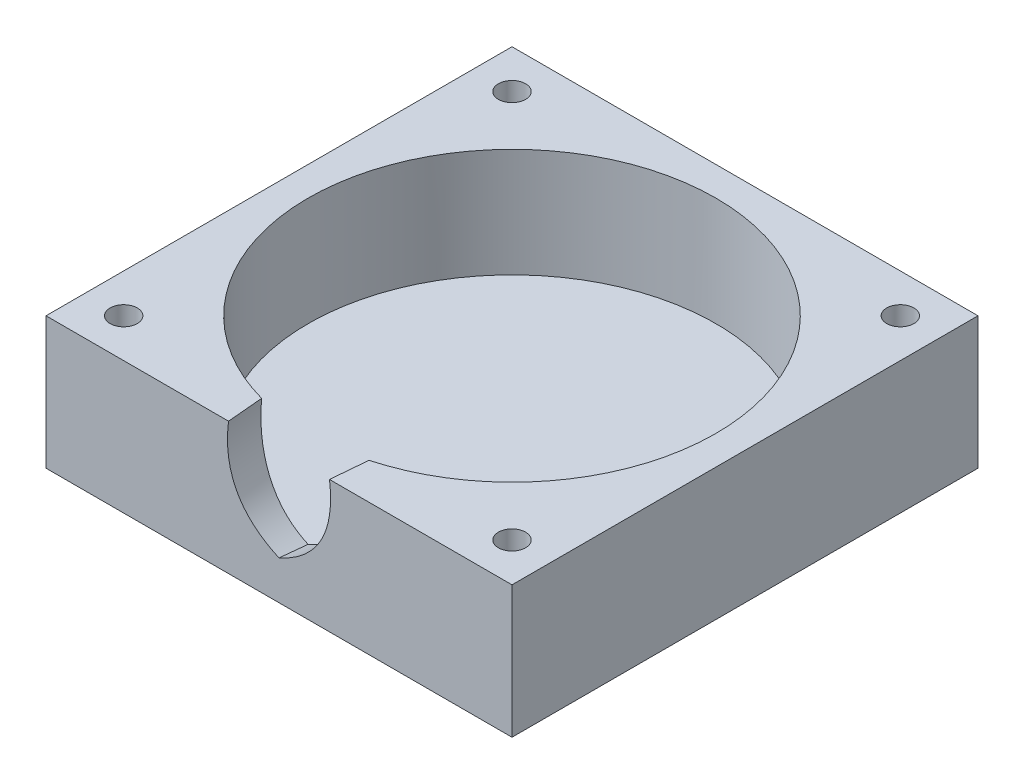
ISO-10303-21;
HEADER;
FILE_DESCRIPTION(('STEP AP214'),'2;1');
FILE_NAME('part.step','',(''),(''),'','','');
FILE_SCHEMA(('AUTOMOTIVE_DESIGN { 1 0 10303 214 1 1 1 1 }'));
ENDSEC;
DATA;
#1=APPLICATION_CONTEXT('core data for automotive mechanical design processes');
#2=APPLICATION_PROTOCOL_DEFINITION('international standard','automotive_design',2000,#1);
#3=PRODUCT_CONTEXT('',#1,'mechanical');
#4=PRODUCT('Part','Part','',(#3));
#5=PRODUCT_RELATED_PRODUCT_CATEGORY('part','',(#4));
#6=PRODUCT_DEFINITION_FORMATION('','',#4);
#7=PRODUCT_DEFINITION_CONTEXT('part definition',#1,'design');
#8=PRODUCT_DEFINITION('design','',#6,#7);
#9=PRODUCT_DEFINITION_SHAPE('','',#8);
#10=(LENGTH_UNIT() NAMED_UNIT(*) SI_UNIT(.MILLI.,.METRE.));
#11=(NAMED_UNIT(*) PLANE_ANGLE_UNIT() SI_UNIT($,.RADIAN.));
#12=(NAMED_UNIT(*) SI_UNIT($,.STERADIAN.) SOLID_ANGLE_UNIT());
#13=UNCERTAINTY_MEASURE_WITH_UNIT(LENGTH_MEASURE(1.E-05),#10,'distance_accuracy_value','');
#14=(GEOMETRIC_REPRESENTATION_CONTEXT(3) GLOBAL_UNCERTAINTY_ASSIGNED_CONTEXT((#13)) GLOBAL_UNIT_ASSIGNED_CONTEXT((#10,
#11,#12)) REPRESENTATION_CONTEXT('',''));
#15=CARTESIAN_POINT('',(0.,0.,0.));
#16=DIRECTION('',(0.,0.,1.));
#17=DIRECTION('',(1.,0.,0.));
#18=AXIS2_PLACEMENT_3D('',#15,#16,#17);
#19=CARTESIAN_POINT('',(-25.,17.001,25.));
#20=DIRECTION('',(0.,-1.,0.));
#21=DIRECTION('',(0.,0.,-1.));
#22=AXIS2_PLACEMENT_3D('',#19,#20,#21);
#23=CYLINDRICAL_SURFACE('',#22,1.75);
#24=CARTESIAN_POINT('',(-25.,17.,25.));
#25=DIRECTION('',(0.,1.,0.));
#26=DIRECTION('',(0.,0.,1.));
#27=AXIS2_PLACEMENT_3D('',#24,#25,#26);
#28=CIRCLE('',#27,1.75);
#29=CARTESIAN_POINT('',(-25.,17.,26.75));
#30=VERTEX_POINT('',#29);
#31=EDGE_CURVE('E116',#30,#30,#28,.F.);
#32=ORIENTED_EDGE('',*,*,#31,.F.);
#33=EDGE_LOOP('',(#32));
#34=FACE_BOUND('',#33,.T.);
#35=CARTESIAN_POINT('',(-25.,3.,25.));
#36=DIRECTION('',(0.,-1.,0.));
#37=DIRECTION('',(0.,0.,-1.));
#38=AXIS2_PLACEMENT_3D('',#35,#36,#37);
#39=CIRCLE('',#38,1.75);
#40=CARTESIAN_POINT('',(-25.,3.,23.25));
#41=VERTEX_POINT('',#40);
#42=EDGE_CURVE('E37',#41,#41,#39,.F.);
#43=ORIENTED_EDGE('',*,*,#42,.F.);
#44=EDGE_LOOP('',(#43));
#45=FACE_BOUND('',#44,.T.);
#46=ADVANCED_FACE('F33',(#34,#45),#23,.F.);
#47=CARTESIAN_POINT('',(25.,17.001,-25.));
#48=DIRECTION('',(0.,-1.,0.));
#49=DIRECTION('',(0.,0.,-1.));
#50=AXIS2_PLACEMENT_3D('',#47,#48,#49);
#51=CYLINDRICAL_SURFACE('',#50,1.75);
#52=CARTESIAN_POINT('',(25.,17.,-25.));
#53=DIRECTION('',(0.,1.,0.));
#54=DIRECTION('',(0.,0.,1.));
#55=AXIS2_PLACEMENT_3D('',#52,#53,#54);
#56=CIRCLE('',#55,1.75);
#57=CARTESIAN_POINT('',(25.,17.,-23.25));
#58=VERTEX_POINT('',#57);
#59=EDGE_CURVE('E320',#58,#58,#56,.F.);
#60=ORIENTED_EDGE('',*,*,#59,.F.);
#61=EDGE_LOOP('',(#60));
#62=FACE_BOUND('',#61,.T.);
#63=CARTESIAN_POINT('',(25.,3.,-25.));
#64=DIRECTION('',(0.,-1.,0.));
#65=DIRECTION('',(0.,0.,-1.));
#66=AXIS2_PLACEMENT_3D('',#63,#64,#65);
#67=CIRCLE('',#66,1.75);
#68=CARTESIAN_POINT('',(25.,3.,-26.75));
#69=VERTEX_POINT('',#68);
#70=EDGE_CURVE('E298',#69,#69,#67,.F.);
#71=ORIENTED_EDGE('',*,*,#70,.F.);
#72=EDGE_LOOP('',(#71));
#73=FACE_BOUND('',#72,.T.);
#74=ADVANCED_FACE('F241',(#62,#73),#51,.F.);
#75=CARTESIAN_POINT('',(30.,17.,-30.));
#76=DIRECTION('',(-1.,0.,0.));
#77=DIRECTION('',(0.,0.,1.));
#78=AXIS2_PLACEMENT_3D('',#75,#76,#77);
#79=PLANE('',#78);
#80=DIRECTION('',(0.,0.,-1.));
#81=VECTOR('',#80,1.);
#82=CARTESIAN_POINT('',(30.,0.,-30.));
#83=LINE('',#82,#81);
#84=CARTESIAN_POINT('',(30.,0.,30.));
#85=VERTEX_POINT('',#84);
#86=CARTESIAN_POINT('',(30.,0.,-30.));
#87=VERTEX_POINT('',#86);
#88=EDGE_CURVE('E199',#85,#87,#83,.T.);
#89=ORIENTED_EDGE('',*,*,#88,.T.);
#90=DIRECTION('',(0.,-1.,0.));
#91=VECTOR('',#90,1.);
#92=CARTESIAN_POINT('',(30.,17.,-30.));
#93=LINE('',#92,#91);
#94=CARTESIAN_POINT('',(30.,17.,-30.));
#95=VERTEX_POINT('',#94);
#96=EDGE_CURVE('E170',#95,#87,#93,.T.);
#97=ORIENTED_EDGE('',*,*,#96,.F.);
#98=DIRECTION('',(0.,0.,-1.));
#99=VECTOR('',#98,1.);
#100=CARTESIAN_POINT('',(30.,17.,-30.));
#101=LINE('',#100,#99);
#102=CARTESIAN_POINT('',(30.,17.,30.));
#103=VERTEX_POINT('',#102);
#104=EDGE_CURVE('E202',#103,#95,#101,.T.);
#105=ORIENTED_EDGE('',*,*,#104,.F.);
#106=DIRECTION('',(0.,-1.,0.));
#107=VECTOR('',#106,1.);
#108=CARTESIAN_POINT('',(30.,17.,30.));
#109=LINE('',#108,#107);
#110=EDGE_CURVE('E209',#103,#85,#109,.T.);
#111=ORIENTED_EDGE('',*,*,#110,.T.);
#112=EDGE_LOOP('',(#89,#97,#105,#111));
#113=FACE_BOUND('',#112,.T.);
#114=ADVANCED_FACE('F35',(#113),#79,.F.);
#115=CARTESIAN_POINT('',(-30.,17.,-30.));
#116=DIRECTION('',(0.,0.,1.));
#117=DIRECTION('',(1.,0.,0.));
#118=AXIS2_PLACEMENT_3D('',#115,#116,#117);
#119=PLANE('',#118);
#120=DIRECTION('',(-1.,0.,0.));
#121=VECTOR('',#120,1.);
#122=CARTESIAN_POINT('',(-30.,0.,-30.));
#123=LINE('',#122,#121);
#124=CARTESIAN_POINT('',(-30.,0.,-30.));
#125=VERTEX_POINT('',#124);
#126=EDGE_CURVE('E212',#87,#125,#123,.T.);
#127=ORIENTED_EDGE('',*,*,#126,.T.);
#128=DIRECTION('',(0.,-1.,0.));
#129=VECTOR('',#128,1.);
#130=CARTESIAN_POINT('',(-30.,17.,-30.));
#131=LINE('',#130,#129);
#132=CARTESIAN_POINT('',(-30.,17.,-30.));
#133=VERTEX_POINT('',#132);
#134=EDGE_CURVE('E219',#133,#125,#131,.T.);
#135=ORIENTED_EDGE('',*,*,#134,.F.);
#136=DIRECTION('',(-1.,0.,0.));
#137=VECTOR('',#136,1.);
#138=CARTESIAN_POINT('',(-30.,17.,-30.));
#139=LINE('',#138,#137);
#140=EDGE_CURVE('E88',#95,#133,#139,.T.);
#141=ORIENTED_EDGE('',*,*,#140,.F.);
#142=ORIENTED_EDGE('',*,*,#96,.T.);
#143=EDGE_LOOP('',(#127,#135,#141,#142));
#144=FACE_BOUND('',#143,.T.);
#145=ADVANCED_FACE('F225',(#144),#119,.F.);
#146=CARTESIAN_POINT('',(-30.,17.,-30.));
#147=DIRECTION('',(1.,0.,0.));
#148=DIRECTION('',(0.,0.,-1.));
#149=AXIS2_PLACEMENT_3D('',#146,#147,#148);
#150=PLANE('',#149);
#151=DIRECTION('',(0.,0.,1.));
#152=VECTOR('',#151,1.);
#153=CARTESIAN_POINT('',(-30.,0.,-30.));
#154=LINE('',#153,#152);
#155=CARTESIAN_POINT('',(-30.,0.,30.));
#156=VERTEX_POINT('',#155);
#157=EDGE_CURVE('E214',#125,#156,#154,.T.);
#158=ORIENTED_EDGE('',*,*,#157,.T.);
#159=DIRECTION('',(0.,-1.,0.));
#160=VECTOR('',#159,1.);
#161=CARTESIAN_POINT('',(-30.,17.,30.));
#162=LINE('',#161,#160);
#163=CARTESIAN_POINT('',(-30.,17.,30.));
#164=VERTEX_POINT('',#163);
#165=EDGE_CURVE('E218',#164,#156,#162,.T.);
#166=ORIENTED_EDGE('',*,*,#165,.F.);
#167=DIRECTION('',(0.,0.,1.));
#168=VECTOR('',#167,1.);
#169=CARTESIAN_POINT('',(-30.,17.,-30.));
#170=LINE('',#169,#168);
#171=EDGE_CURVE('E205',#133,#164,#170,.T.);
#172=ORIENTED_EDGE('',*,*,#171,.F.);
#173=ORIENTED_EDGE('',*,*,#134,.T.);
#174=EDGE_LOOP('',(#158,#166,#172,#173));
#175=FACE_BOUND('',#174,.T.);
#176=ADVANCED_FACE('F231',(#175),#150,.F.);
#177=CARTESIAN_POINT('',(-30.,17.,30.));
#178=DIRECTION('',(0.,0.,-1.));
#179=DIRECTION('',(-1.,0.,0.));
#180=AXIS2_PLACEMENT_3D('',#177,#178,#179);
#181=PLANE('',#180);
#182=CARTESIAN_POINT('',(0.,5.,30.));
#183=CARTESIAN_POINT('',(0.208677704389736,5.09339119455351,30.));
#184=CARTESIAN_POINT('',(0.415477367813616,5.19108473560359,30.));
#185=CARTESIAN_POINT('',(0.825002892385393,5.3959124771717,30.));
#186=CARTESIAN_POINT('',(1.02771695198422,5.50307023572055,30.));
#187=CARTESIAN_POINT('',(1.4278414401957,5.72728278919204,30.));
#188=CARTESIAN_POINT('',(1.62524731508157,5.84434574561954,30.));
#189=CARTESIAN_POINT('',(2.01551276398863,6.0900487214322,30.));
#190=CARTESIAN_POINT('',(2.20830678036778,6.21879318952291,30.));
#191=CARTESIAN_POINT('',(2.58594860030791,6.48719324613669,30.));
#192=CARTESIAN_POINT('',(2.77080239449202,6.62684037659215,30.));
#193=CARTESIAN_POINT('',(3.13133968742448,6.91736368444327,30.));
#194=CARTESIAN_POINT('',(3.30702745103543,7.0682345588216,30.));
#195=CARTESIAN_POINT('',(3.67438405637825,7.40564076686896,30.));
#196=CARTESIAN_POINT('',(3.8643140794276,7.59408086388706,30.));
#197=CARTESIAN_POINT('',(4.22813646443127,7.98589458943577,30.));
#198=CARTESIAN_POINT('',(4.40202848471304,8.18926853595042,30.));
#199=CARTESIAN_POINT('',(4.73083509686201,8.60886771594631,30.));
#200=CARTESIAN_POINT('',(4.88585772519023,8.8250081288996,30.));
#201=CARTESIAN_POINT('',(5.17658701038929,9.26990969649673,30.));
#202=CARTESIAN_POINT('',(5.31229424957962,9.49867047037386,30.));
#203=CARTESIAN_POINT('',(5.56335475411501,9.96698906621335,30.));
#204=CARTESIAN_POINT('',(5.67871507573207,10.2065431087646,30.));
#205=CARTESIAN_POINT('',(5.88878173794398,10.6945304588953,30.));
#206=CARTESIAN_POINT('',(5.98348721055737,10.9429641391147,30.));
#207=CARTESIAN_POINT('',(6.15304922473778,11.4482748878111,30.));
#208=CARTESIAN_POINT('',(6.22777316451845,11.7051962386039,30.));
#209=CARTESIAN_POINT('',(6.35736217885725,12.2239621622867,30.));
#210=CARTESIAN_POINT('',(6.41222753357979,12.4858066656661,30.));
#211=CARTESIAN_POINT('',(6.49838998945198,12.9843444520008,30.));
#212=CARTESIAN_POINT('',(6.53158684998097,13.2207149952184,30.));
#213=CARTESIAN_POINT('',(6.58411772320787,13.6950797319929,30.));
#214=CARTESIAN_POINT('',(6.60344564660402,13.9330745924846,30.));
#215=CARTESIAN_POINT('',(6.62927745878273,14.4099091630195,30.));
#216=CARTESIAN_POINT('',(6.6357721451913,14.6487493563755,30.));
#217=CARTESIAN_POINT('',(6.6369603821806,15.1232787711126,30.));
#218=CARTESIAN_POINT('',(6.63180912162126,15.3589678213186,30.));
#219=CARTESIAN_POINT('',(6.61101685488044,15.8296741492819,30.));
#220=CARTESIAN_POINT('',(6.59538430877058,16.0646918154309,30.));
#221=CARTESIAN_POINT('',(6.55459135614999,16.5333329832363,30.));
#222=CARTESIAN_POINT('',(6.52945404158036,16.7669584808806,30.));
#223=CARTESIAN_POINT('',(6.5,17.,30.));
#224=B_SPLINE_CURVE_WITH_KNOTS('',3,(#182,#183,#184,#185,#186,#187,#188,#189,#190,#191,#192,
#193,#194,#195,#196,#197,#198,#199,#200,#201,#202,#203,#204,#205,#206,#207,#208,#209,#210,#211,
#212,#213,#214,#215,#216,#217,#218,#219,#220,#221,#222,#223),.UNSPECIFIED.,.F.,.F.,(4,2,2,2,2,2,
2,2,2,2,2,2,2,2,2,2,2,2,2,2,4),(0.,0.685884281202188,1.37352674209739,2.0617414168804,
2.75686689534993,3.45145836786651,4.14572371762104,4.94750970688125,5.74931277339415,
6.54628450890118,7.34323221224868,8.13990298989631,8.93660723969788,9.73847428395821,
10.5403300150579,11.255971958328,11.9719279197302,12.6883970881284,13.3953752559481,
14.1017834653366,14.8064863619763),.UNSPECIFIED.);
#225=CARTESIAN_POINT('',(0.,5.,30.));
#226=VERTEX_POINT('',#225);
#227=CARTESIAN_POINT('',(6.5,17.,30.));
#228=VERTEX_POINT('',#227);
#229=EDGE_CURVE('E106',#226,#228,#224,.T.);
#230=ORIENTED_EDGE('',*,*,#229,.F.);
#231=CARTESIAN_POINT('',(-6.5,17.,30.));
#232=CARTESIAN_POINT('',(-6.5342369893857,16.7290648986574,30.));
#233=CARTESIAN_POINT('',(-6.56265004892543,16.4573214943799,30.));
#234=CARTESIAN_POINT('',(-6.60648681273091,15.9116591149733,30.));
#235=CARTESIAN_POINT('',(-6.62185584604961,15.63773579311,30.));
#236=CARTESIAN_POINT('',(-6.63796459448942,15.0890382936317,30.));
#237=CARTESIAN_POINT('',(-6.63868368102874,14.8142634610548,30.));
#238=CARTESIAN_POINT('',(-6.6237567880538,14.26168092235,30.));
#239=CARTESIAN_POINT('',(-6.60790566907323,13.9838783476969,29.9999999999999));
#240=CARTESIAN_POINT('',(-6.55787423522459,13.4302521615077,30.0000000000001));
#241=CARTESIAN_POINT('',(-6.52371766802398,13.1544264541402,30.0000000000002));
#242=CARTESIAN_POINT('',(-6.43552350360031,12.606180356309,29.9999999999998));
#243=CARTESIAN_POINT('',(-6.38150379965313,12.333757128464,29.9999999999992));
#244=CARTESIAN_POINT('',(-6.25425560660775,11.8025068378039,29.9999999999992));
#245=CARTESIAN_POINT('',(-6.18168900131731,11.5435223187122,29.9999999999998));
#246=CARTESIAN_POINT('',(-6.01574625571677,11.0322592921642,30.0000000000002));
#247=CARTESIAN_POINT('',(-5.92236933675181,10.77998103603,30.0000000000001));
#248=CARTESIAN_POINT('',(-5.71516796627037,10.2859454945874,30.));
#249=CARTESIAN_POINT('',(-5.60148591101389,10.044128647526,30.));
#250=CARTESIAN_POINT('',(-5.35355747509038,9.5712770973322,30.));
#251=CARTESIAN_POINT('',(-5.21931190003996,9.34024197226689,30.));
#252=CARTESIAN_POINT('',(-4.93105303235904,8.89051972304292,30.));
#253=CARTESIAN_POINT('',(-4.77701940702905,8.67184563769045,30.));
#254=CARTESIAN_POINT('',(-4.45080791289394,8.24848811781857,30.));
#255=CARTESIAN_POINT('',(-4.27862919782181,8.0438053365728,30.));
#256=CARTESIAN_POINT('',(-3.91699510458954,7.64815150778302,30.));
#257=CARTESIAN_POINT('',(-3.7274445381369,7.45726769151232,30.));
#258=CARTESIAN_POINT('',(-3.33408345917791,7.09087849071356,30.));
#259=CARTESIAN_POINT('',(-3.13027334014748,6.91537268214788,30.));
#260=CARTESIAN_POINT('',(-2.69709379559939,6.56883461396647,30.));
#261=CARTESIAN_POINT('',(-2.46692336762008,6.3988068593203,30.));
#262=CARTESIAN_POINT('',(-1.99521788249431,6.07532477032934,30.));
#263=CARTESIAN_POINT('',(-1.75368135980035,5.92187258169553,30.));
#264=CARTESIAN_POINT('',(-1.34519212707646,5.68020984968072,30.));
#265=CARTESIAN_POINT('',(-1.18083228670511,5.58756919808658,30.));
#266=CARTESIAN_POINT('',(-0.848681300599543,5.40882054216754,30.));
#267=CARTESIAN_POINT('',(-0.680891501188341,5.32271003485572,30.));
#268=CARTESIAN_POINT('',(-0.342492316691785,5.1567651099767,30.));
#269=CARTESIAN_POINT('',(-0.171886700625574,5.0769230148539,30.));
#270=CARTESIAN_POINT('',(0.,5.,30.));
#271=B_SPLINE_CURVE_WITH_KNOTS('',3,(#231,#232,#233,#234,#235,#236,#237,#238,#239,#240,#241,
#242,#243,#244,#245,#246,#247,#248,#249,#250,#251,#252,#253,#254,#255,#256,#257,#258,#259,#260,
#261,#262,#263,#264,#265,#266,#267,#268,#269,#270),.UNSPECIFIED.,.F.,.F.,(4,2,2,2,2,2,2,2,2,2,2,
2,2,2,2,2,2,2,2,4),(0.,0.81931338543241,1.64204400541852,2.46593303197979,3.30014399460672,
4.13327534537106,4.96565801917527,5.77170266013272,6.57777746574799,7.37840677613279,
8.17900472829755,8.98043199434239,9.78189665462849,10.5880505238176,11.3941821568874,
12.2518860429974,13.1097008263554,13.6755742677294,14.2412297033785,14.8061811502168),.UNSPECIFIED.);
#272=CARTESIAN_POINT('',(-6.5,17.,30.));
#273=VERTEX_POINT('',#272);
#274=EDGE_CURVE('E110',#273,#226,#271,.T.);
#275=ORIENTED_EDGE('',*,*,#274,.F.);
#276=DIRECTION('',(1.,0.,0.));
#277=VECTOR('',#276,1.);
#278=CARTESIAN_POINT('',(-30.,17.,30.));
#279=LINE('',#278,#277);
#280=EDGE_CURVE('E207',#164,#273,#279,.T.);
#281=ORIENTED_EDGE('',*,*,#280,.F.);
#282=ORIENTED_EDGE('',*,*,#165,.T.);
#283=DIRECTION('',(1.,0.,0.));
#284=VECTOR('',#283,1.);
#285=CARTESIAN_POINT('',(-30.,0.,30.));
#286=LINE('',#285,#284);
#287=EDGE_CURVE('E80',#156,#85,#286,.T.);
#288=ORIENTED_EDGE('',*,*,#287,.T.);
#289=ORIENTED_EDGE('',*,*,#110,.F.);
#290=EDGE_CURVE('E58',#228,#103,#279,.T.);
#291=ORIENTED_EDGE('',*,*,#290,.F.);
#292=EDGE_LOOP('',(#230,#275,#281,#282,#288,#289,#291));
#293=FACE_BOUND('',#292,.T.);
#294=ADVANCED_FACE('F118',(#293),#181,.F.);
#295=CARTESIAN_POINT('',(0.,17.,0.));
#296=DIRECTION('',(0.,1.,0.));
#297=DIRECTION('',(0.,0.,1.));
#298=AXIS2_PLACEMENT_3D('',#295,#296,#297);
#299=PLANE('',#298);
#300=CARTESIAN_POINT('',(-25.,17.,-25.));
#301=DIRECTION('',(0.,1.,0.));
#302=DIRECTION('',(0.,0.,1.));
#303=AXIS2_PLACEMENT_3D('',#300,#301,#302);
#304=CIRCLE('',#303,1.75);
#305=CARTESIAN_POINT('',(-25.,17.,-23.25));
#306=VERTEX_POINT('',#305);
#307=EDGE_CURVE('E300',#306,#306,#304,.F.);
#308=ORIENTED_EDGE('',*,*,#307,.T.);
#309=EDGE_LOOP('',(#308));
#310=FACE_BOUND('',#309,.T.);
#311=ORIENTED_EDGE('',*,*,#59,.T.);
#312=EDGE_LOOP('',(#311));
#313=FACE_BOUND('',#312,.T.);
#314=CARTESIAN_POINT('',(25.,17.,25.));
#315=DIRECTION('',(0.,1.,0.));
#316=DIRECTION('',(0.,0.,1.));
#317=AXIS2_PLACEMENT_3D('',#314,#315,#316);
#318=CIRCLE('',#317,1.75);
#319=CARTESIAN_POINT('',(25.,17.,26.75));
#320=VERTEX_POINT('',#319);
#321=EDGE_CURVE('E317',#320,#320,#318,.F.);
#322=ORIENTED_EDGE('',*,*,#321,.T.);
#323=EDGE_LOOP('',(#322));
#324=FACE_BOUND('',#323,.T.);
#325=ORIENTED_EDGE('',*,*,#31,.T.);
#326=EDGE_LOOP('',(#325));
#327=FACE_BOUND('',#326,.T.);
#328=CARTESIAN_POINT('',(-7.82208871050752,16.9999999999973,15.000000000002));
#329=CARTESIAN_POINT('',(-7.67950878285276,16.999999999999,16.6184578295682));
#330=CARTESIAN_POINT('',(-7.53690791861311,16.9999999999997,18.2369138148231));
#331=CARTESIAN_POINT('',(-7.24528819772684,17.0000000000003,21.5461443483866));
#332=CARTESIAN_POINT('',(-7.09626729862367,17.0000000000002,23.2369187167072));
#333=CARTESIAN_POINT('',(-6.79817347574376,16.9999999999998,26.6184628687713));
#334=CARTESIAN_POINT('',(-6.64910055196697,16.9999999999997,28.3092326525148));
#335=CARTESIAN_POINT('',(-6.5,17.,30.));
#336=B_SPLINE_CURVE_WITH_KNOTS('',3,(#328,#329,#330,#331,#332,#333,#334,#335),.UNSPECIFIED.,.F.,
.F.,(4,2,2,4),(0.,4.87417819096908,9.96616471183927,15.0581512374287),.UNSPECIFIED.);
#337=CARTESIAN_POINT('',(-6.91232349726326,17.,25.3235519599677));
#338=VERTEX_POINT('',#337);
#339=EDGE_CURVE('E113',#338,#273,#336,.T.);
#340=ORIENTED_EDGE('',*,*,#339,.F.);
#341=CARTESIAN_POINT('',(0.,17.,0.));
#342=DIRECTION('',(0.,1.,0.));
#343=DIRECTION('',(0.,0.,1.));
#344=AXIS2_PLACEMENT_3D('',#341,#342,#343);
#345=CIRCLE('',#344,26.25);
#346=CARTESIAN_POINT('',(6.9123234972632,17.,25.3235519599677));
#347=VERTEX_POINT('',#346);
#348=EDGE_CURVE('E195',#347,#338,#345,.T.);
#349=ORIENTED_EDGE('',*,*,#348,.F.);
#350=CARTESIAN_POINT('',(6.5,17.,30.));
#351=CARTESIAN_POINT('',(6.64272282028409,17.,28.3815547648708));
#352=CARTESIAN_POINT('',(6.78542032176914,17.,26.7631072971184));
#353=CARTESIAN_POINT('',(7.07714306255445,17.,23.453885843587));
#354=CARTESIAN_POINT('',(7.22616611820943,17.,21.763111665309));
#355=CARTESIAN_POINT('',(7.52416330127347,17.,18.3815589955089));
#356=CARTESIAN_POINT('',(7.67313742868249,17.,16.6907805039868));
#357=CARTESIAN_POINT('',(7.82208871050758,17.,14.9999999999921));
#358=B_SPLINE_CURVE_WITH_KNOTS('',3,(#350,#351,#352,#353,#354,#355,#356,#357),.UNSPECIFIED.,.F.,
.F.,(4,2,2,4),(0.,4.87417819115706,9.96616471212156,15.0581512374425),.UNSPECIFIED.);
#359=EDGE_CURVE('E50',#228,#347,#358,.T.);
#360=ORIENTED_EDGE('',*,*,#359,.F.);
#361=ORIENTED_EDGE('',*,*,#290,.T.);
#362=ORIENTED_EDGE('',*,*,#104,.T.);
#363=ORIENTED_EDGE('',*,*,#140,.T.);
#364=ORIENTED_EDGE('',*,*,#171,.T.);
#365=ORIENTED_EDGE('',*,*,#280,.T.);
#366=EDGE_LOOP('',(#340,#349,#360,#361,#362,#363,#364,#365));
#367=FACE_BOUND('',#366,.T.);
#368=ADVANCED_FACE('F182',(#310,#313,#324,#327,#367),#299,.T.);
#369=CARTESIAN_POINT('',(0.,0.,0.));
#370=DIRECTION('',(0.,1.,0.));
#371=DIRECTION('',(0.,0.,1.));
#372=AXIS2_PLACEMENT_3D('',#369,#370,#371);
#373=PLANE('',#372);
#374=CARTESIAN_POINT('',(-25.,0.,-25.));
#375=DIRECTION('',(0.,-1.,0.));
#376=DIRECTION('',(0.,0.,1.));
#377=AXIS2_PLACEMENT_3D('',#374,#375,#376);
#378=CIRCLE('',#377,2.9);
#379=CARTESIAN_POINT('',(-25.,0.,-22.1));
#380=VERTEX_POINT('',#379);
#381=EDGE_CURVE('E314',#380,#380,#378,.T.);
#382=ORIENTED_EDGE('',*,*,#381,.F.);
#383=EDGE_LOOP('',(#382));
#384=FACE_BOUND('',#383,.T.);
#385=CARTESIAN_POINT('',(25.,0.,-25.));
#386=DIRECTION('',(0.,-1.,0.));
#387=DIRECTION('',(0.,0.,-1.));
#388=AXIS2_PLACEMENT_3D('',#385,#386,#387);
#389=CIRCLE('',#388,2.9);
#390=CARTESIAN_POINT('',(25.,0.,-27.9));
#391=VERTEX_POINT('',#390);
#392=EDGE_CURVE('E340',#391,#391,#389,.T.);
#393=ORIENTED_EDGE('',*,*,#392,.F.);
#394=EDGE_LOOP('',(#393));
#395=FACE_BOUND('',#394,.T.);
#396=CARTESIAN_POINT('',(25.,0.,25.));
#397=DIRECTION('',(0.,-1.,0.));
#398=DIRECTION('',(0.,0.,1.));
#399=AXIS2_PLACEMENT_3D('',#396,#397,#398);
#400=CIRCLE('',#399,2.9);
#401=CARTESIAN_POINT('',(25.,0.,27.9));
#402=VERTEX_POINT('',#401);
#403=EDGE_CURVE('E346',#402,#402,#400,.T.);
#404=ORIENTED_EDGE('',*,*,#403,.F.);
#405=EDGE_LOOP('',(#404));
#406=FACE_BOUND('',#405,.T.);
#407=CARTESIAN_POINT('',(-25.,0.,25.));
#408=DIRECTION('',(0.,-1.,0.));
#409=DIRECTION('',(0.,0.,-1.));
#410=AXIS2_PLACEMENT_3D('',#407,#408,#409);
#411=CIRCLE('',#410,2.9);
#412=CARTESIAN_POINT('',(-25.,0.,22.1));
#413=VERTEX_POINT('',#412);
#414=EDGE_CURVE('E308',#413,#413,#411,.T.);
#415=ORIENTED_EDGE('',*,*,#414,.F.);
#416=EDGE_LOOP('',(#415));
#417=FACE_BOUND('',#416,.T.);
#418=ORIENTED_EDGE('',*,*,#88,.F.);
#419=ORIENTED_EDGE('',*,*,#287,.F.);
#420=ORIENTED_EDGE('',*,*,#157,.F.);
#421=ORIENTED_EDGE('',*,*,#126,.F.);
#422=EDGE_LOOP('',(#418,#419,#420,#421));
#423=FACE_BOUND('',#422,.T.);
#424=ADVANCED_FACE('F180',(#384,#395,#406,#417,#423),#373,.F.);
#425=CARTESIAN_POINT('',(0.,3.,0.));
#426=DIRECTION('',(0.,1.,0.));
#427=DIRECTION('',(0.,0.,1.));
#428=AXIS2_PLACEMENT_3D('',#425,#426,#427);
#429=CYLINDRICAL_SURFACE('',#428,26.25);
#430=CARTESIAN_POINT('',(0.,3.,0.));
#431=DIRECTION('',(0.,1.,0.));
#432=DIRECTION('',(0.,0.,1.));
#433=AXIS2_PLACEMENT_3D('',#430,#431,#432);
#434=CIRCLE('',#433,26.25);
#435=CARTESIAN_POINT('',(0.,3.,26.25));
#436=VERTEX_POINT('',#435);
#437=EDGE_CURVE('E196',#436,#436,#434,.T.);
#438=ORIENTED_EDGE('',*,*,#437,.F.);
#439=EDGE_LOOP('',(#438));
#440=FACE_BOUND('',#439,.T.);
#441=ORIENTED_EDGE('',*,*,#348,.T.);
#442=CARTESIAN_POINT('',(-6.91232349726326,17.,25.3235519599677));
#443=CARTESIAN_POINT('',(-6.93812238724433,16.7964352112432,25.3165073567156));
#444=CARTESIAN_POINT('',(-6.96059964370749,16.5923958646217,25.310331867063));
#445=CARTESIAN_POINT('',(-6.9983994302947,16.1828737092115,25.299907661288));
#446=CARTESIAN_POINT('',(-7.01369609089823,15.9773883478045,25.2956659134124));
#447=CARTESIAN_POINT('',(-7.03645169443222,15.5655524579712,25.2893451786297));
#448=CARTESIAN_POINT('',(-7.04389586010969,15.3592010294362,25.2872702694708));
#449=CARTESIAN_POINT('',(-7.05027347915758,14.9462304274158,25.2854930586395));
#450=CARTESIAN_POINT('',(-7.04920207844033,14.7396111683571,25.2857921101843));
#451=CARTESIAN_POINT('',(-7.03784726679692,14.3246636401255,25.2889549557461));
#452=CARTESIAN_POINT('',(-7.02747615919651,14.1163378502875,25.2918431655795));
#453=CARTESIAN_POINT('',(-6.99676410824475,13.7006544614099,25.3003566770565));
#454=CARTESIAN_POINT('',(-6.97643208378486,13.4932961634543,25.3059795300991));
#455=CARTESIAN_POINT('',(-6.92521036332425,13.0801671208768,25.3200447782613));
#456=CARTESIAN_POINT('',(-6.89433041532482,12.8743950891959,25.3284845699062));
#457=CARTESIAN_POINT('',(-6.82146178920065,12.4650474784633,25.3482067605264));
#458=CARTESIAN_POINT('',(-6.77947822125672,12.2614709337326,25.3594878517465));
#459=CARTESIAN_POINT('',(-6.68925157820868,11.8796923371439,25.3834264244501));
#460=CARTESIAN_POINT('',(-6.64222279557529,11.7011847945816,25.3957915823722));
#461=CARTESIAN_POINT('',(-6.53877458146667,11.3470430447118,25.422623467162));
#462=CARTESIAN_POINT('',(-6.48235416026554,11.171409142384,25.4370904155038));
#463=CARTESIAN_POINT('',(-6.35997817097833,10.8236657654476,25.4679633639976));
#464=CARTESIAN_POINT('',(-6.29402267888046,10.6515562627644,25.4843693486966));
#465=CARTESIAN_POINT('',(-6.15299827032819,10.3125483039555,25.5187841784631));
#466=CARTESIAN_POINT('',(-6.07798898035058,10.1456239737574,25.5367823482048));
#467=CARTESIAN_POINT('',(-5.91861216076977,9.81645947998303,25.5741906523243));
#468=CARTESIAN_POINT('',(-5.83424454500094,9.65421935955333,25.5936007997021));
#469=CARTESIAN_POINT('',(-5.65635824421989,9.33499937486975,25.6335018661778));
#470=CARTESIAN_POINT('',(-5.56284011116493,9.17801919410329,25.6539927200534));
#471=CARTESIAN_POINT('',(-5.31802363010255,8.7927773386868,25.7061017284619));
#472=CARTESIAN_POINT('',(-5.16119108459711,8.56806328470673,25.7381670110589));
#473=CARTESIAN_POINT('',(-4.82906535409415,8.13279219425257,25.8025428820562));
#474=CARTESIAN_POINT('',(-4.65377096739242,7.92223608079981,25.8348534862977));
#475=CARTESIAN_POINT('',(-4.28539570175229,7.51479218906428,25.8985138929556));
#476=CARTESIAN_POINT('',(-4.09221244519064,7.31799604056839,25.9298565972989));
#477=CARTESIAN_POINT('',(-3.6910153158827,6.93979978811273,25.9899986184291));
#478=CARTESIAN_POINT('',(-3.48300250222052,6.75839858671303,26.0187981165163));
#479=CARTESIAN_POINT('',(-3.08112875592736,6.43266520042941,26.0692322730889));
#480=CARTESIAN_POINT('',(-2.88876942578787,6.2865382818938,26.0913125172461));
#481=CARTESIAN_POINT('',(-2.49550424341896,6.00553714529673,26.1318585569584));
#482=CARTESIAN_POINT('',(-2.29459469428717,5.87066787095048,26.1503227693002));
#483=CARTESIAN_POINT('',(-1.98777562448236,5.67648536097161,26.174831513356));
#484=CARTESIAN_POINT('',(-1.88454828633671,5.61308612028446,26.1824724101631));
#485=CARTESIAN_POINT('',(-1.67642823159638,5.48893644309583,26.1966211886996));
#486=CARTESIAN_POINT('',(-1.57153546752252,5.4281860822962,26.2031290380636));
#487=CARTESIAN_POINT('',(-1.36138314571926,5.30991535881766,26.2148830349988));
#488=CARTESIAN_POINT('',(-1.25614002260614,5.25236702541098,26.2201421510525));
#489=CARTESIAN_POINT('',(-1.04430273240792,5.13972603059104,26.2294332822254));
#490=CARTESIAN_POINT('',(-0.937708661274642,5.08463319601615,26.2334653839907));
#491=CARTESIAN_POINT('',(-0.776929658065392,5.00379678252161,26.2385547196581));
#492=CARTESIAN_POINT('',(-0.723206352999744,4.97716018417155,26.2400910169024));
#493=CARTESIAN_POINT('',(-0.6154664915597,4.92447010266427,26.2428391129596));
#494=CARTESIAN_POINT('',(-0.561449937965444,4.89841661399083,26.2440509148434));
#495=CARTESIAN_POINT('',(-0.45312951426268,4.84688473902586,26.2461446318972));
#496=CARTESIAN_POINT('',(-0.398825611753301,4.82140641937176,26.2470265090255));
#497=CARTESIAN_POINT('',(-0.289957286394909,4.77100102764111,26.2484549929904));
#498=CARTESIAN_POINT('',(-0.235392861531211,4.74607395983595,26.24900159723));
#499=CARTESIAN_POINT('',(-0.153412822187384,4.70917012482019,26.2495658542295));
#500=CARTESIAN_POINT('',(-0.126100176864839,4.69696582023413,26.2497113074261));
#501=CARTESIAN_POINT('',(-0.071479625217328,4.67254590192606,26.2499169029085));
#502=CARTESIAN_POINT('',(-0.0441717188999753,4.66033028818608,26.2499770450585));
#503=CARTESIAN_POINT('',(0.0377479300411298,4.62367445002252,26.2500296573048));
#504=CARTESIAN_POINT('',(0.0923557659550428,4.59922515567073,26.249894314321));
#505=CARTESIAN_POINT('',(0.201543025929726,4.55030568144577,26.2492830459025));
#506=CARTESIAN_POINT('',(0.256122453686063,4.52583550868365,26.2488072093126));
#507=CARTESIAN_POINT('',(0.36526598916921,4.47686940700634,26.2475152949));
#508=CARTESIAN_POINT('',(0.419830096833864,4.4523734779885,26.2466992157163));
#509=CARTESIAN_POINT('',(0.474385747460455,4.42786551669509,26.24571313877));
#510=B_SPLINE_CURVE_WITH_KNOTS('',3,(#442,#443,#444,#445,#446,#447,#448,#449,#450,#451,#452,
#453,#454,#455,#456,#457,#458,#459,#460,#461,#462,#463,#464,#465,#466,#467,#468,#469,#470,#471,
#472,#473,#474,#475,#476,#477,#478,#479,#480,#481,#482,#483,#484,#485,#486,#487,#488,#489,#490,
#491,#492,#493,#494,#495,#496,#497,#498,#499,#500,#501,#502,#503,#504,#505,#506,#507,#508,#509),
.UNSPECIFIED.,.F.,.F.,(4,2,2,2,2,2,2,2,2,2,2,2,2,2,2,2,2,2,2,2,2,2,2,2,2,2,2,2,2,2,2,2,2,4),(0.,
0.615947438027767,1.23409723339858,1.8534082327164,2.47307228023595,3.09864196360657,
3.72365253991283,4.34808706032584,4.97223469796873,5.52701354108927,6.0818508859312,
6.63668380933077,7.18804393621867,7.73940914010818,8.29074110624384,9.11737398440061,
9.94406070241289,10.7758114916988,11.607502939138,12.3347863097657,13.0623873996584,
13.4264986563669,13.7906203121316,14.1507765759197,14.5109074011949,14.6908553903447,
14.870801676468,15.0507687047531,15.2307371270302,15.3204838813998,15.4102307786522,
15.5897240365479,15.7691704764445,15.9486176341532),.UNSPECIFIED.);
#511=CARTESIAN_POINT('',(2.38854397279767E-13,4.64056499715629,26.2499999999844));
#512=VERTEX_POINT('',#511);
#513=EDGE_CURVE('E11',#338,#512,#510,.T.);
#514=ORIENTED_EDGE('',*,*,#513,.T.);
#515=CARTESIAN_POINT('',(-0.47438574745865,4.42786551669493,26.2457131387701));
#516=CARTESIAN_POINT('',(-0.427799704346574,4.44879225929376,26.2465551596495));
#517=CARTESIAN_POINT('',(-0.381208084484437,4.4697115870662,26.2472732262281));
#518=CARTESIAN_POINT('',(-0.288013788836005,4.5115314125713,26.2484612870434));
#519=CARTESIAN_POINT('',(-0.241411113164077,4.53243191048886,26.248931283743));
#520=CARTESIAN_POINT('',(-0.14818499028648,4.57421447512309,26.2496231237462));
#521=CARTESIAN_POINT('',(-0.101561540814467,4.59509653756494,26.2498449197108));
#522=CARTESIAN_POINT('',(-0.00831076948641943,4.63685435439712,26.2500401094877));
#523=CARTESIAN_POINT('',(0.0383165524011699,4.65773010872791,26.250013501025));
#524=CARTESIAN_POINT('',(0.1083690518504,4.68903135316387,26.2497867319228));
#525=CARTESIAN_POINT('',(0.131782925469519,4.69948282098274,26.2496796182898));
#526=CARTESIAN_POINT('',(0.178569233912588,4.72047716563351,26.2494030550072));
#527=CARTESIAN_POINT('',(0.201941668898134,4.73102004210801,26.2492336056013));
#528=CARTESIAN_POINT('',(0.271986915397956,4.76280393325046,26.2486324143894));
#529=CARTESIAN_POINT('',(0.318588456265233,4.78420055869416,26.2481078270156));
#530=CARTESIAN_POINT('',(0.411592453569852,4.8274035839577,26.2468141734879));
#531=CARTESIAN_POINT('',(0.457994928282217,4.8492099451287,26.2460451302848));
#532=CARTESIAN_POINT('',(0.550596051691978,4.89324306173831,26.244265825517));
#533=CARTESIAN_POINT('',(0.596794697122235,4.91546982388548,26.2432555601));
#534=CARTESIAN_POINT('',(0.735209133355761,4.98285556771172,26.2398646140744));
#535=CARTESIAN_POINT('',(0.827105367673781,5.02865593890703,26.2371257220381));
#536=CARTESIAN_POINT('',(1.00997455113156,5.12201450474145,26.2307228842467));
#537=CARTESIAN_POINT('',(1.1009474424201,5.16957280866623,26.2270588808973));
#538=CARTESIAN_POINT('',(1.28192943066565,5.26651402482697,26.2188360757958));
#539=CARTESIAN_POINT('',(1.37193807344298,5.31589775199889,26.2142768703789));
#540=CARTESIAN_POINT('',(1.55086351928236,5.41651203948761,26.204300283617));
#541=CARTESIAN_POINT('',(1.63978035105416,5.46774255110217,26.1988829248899));
#542=CARTESIAN_POINT('',(1.90661870272389,5.62536469473894,26.1812774505278));
#543=CARTESIAN_POINT('',(2.08274534231191,5.73468273622614,26.1678226544041));
#544=CARTESIAN_POINT('',(2.42931634620688,5.9612829540819,26.1379255892607));
#545=CARTESIAN_POINT('',(2.59976553656668,6.07855809496552,26.1214859383675));
#546=CARTESIAN_POINT('',(2.93421961602684,6.32133672336585,26.0860327573171));
#547=CARTESIAN_POINT('',(3.09822980827602,6.4468332023589,26.0670214051298));
#548=CARTESIAN_POINT('',(3.41904596440608,6.70627120822322,26.0268853066725));
#549=CARTESIAN_POINT('',(3.57585484347391,6.84020926479977,26.0057614267846));
#550=CARTESIAN_POINT('',(3.93499974824523,7.16507765966795,25.9542228282181));
#551=CARTESIAN_POINT('',(4.1340640336832,7.35954951337924,25.9231437477707));
#552=CARTESIAN_POINT('',(4.51555523616702,7.76398929326471,25.8594217206452));
#553=CARTESIAN_POINT('',(4.69798102621222,7.97395826738885,25.8267786682603));
#554=CARTESIAN_POINT('',(5.04310730502762,8.40731642949262,25.7616037369256));
#555=CARTESIAN_POINT('',(5.20592814031079,8.63060966418427,25.7290725116247));
#556=CARTESIAN_POINT('',(5.51162882344924,9.09062458957469,25.6653238047664));
#557=CARTESIAN_POINT('',(5.65450982308314,9.32734550354269,25.6341062474008));
#558=CARTESIAN_POINT('',(5.91935346065749,9.81289184192357,25.5742494064799));
#559=CARTESIAN_POINT('',(6.0412911146107,10.0617312751064,25.5456132214032));
#560=CARTESIAN_POINT('',(6.263541636823,10.5692664562583,25.4920306403624));
#561=CARTESIAN_POINT('',(6.36385353744981,10.8279626446531,25.4670844095188));
#562=CARTESIAN_POINT('',(6.54346591699021,11.3547305439715,25.4215302794797));
#563=CARTESIAN_POINT('',(6.62262965730011,11.6228511587292,25.4009507823615));
#564=CARTESIAN_POINT('',(6.75977904760239,12.1647482571427,25.3647968951292));
#565=CARTESIAN_POINT('',(6.81776531706695,12.4385245751133,25.3492223586141));
#566=CARTESIAN_POINT('',(6.90687274482147,12.95073690111,25.3250745590981));
#567=CARTESIAN_POINT('',(6.94063471649653,13.1886902686961,25.315822350024));
#568=CARTESIAN_POINT('',(6.99426538681597,13.6663628760851,25.3010578295397));
#569=CARTESIAN_POINT('',(7.01412810588928,13.9060828311281,25.2955471277864));
#570=CARTESIAN_POINT('',(7.04091066019172,14.3864517555935,25.2881052243075));
#571=CARTESIAN_POINT('',(7.04782115246484,14.6271012702555,25.2861766064905));
#572=CARTESIAN_POINT('',(7.0496678355499,15.1057033712043,25.2856614503483));
#573=CARTESIAN_POINT('',(7.04473895196188,15.3436555881892,25.287037253686));
#574=CARTESIAN_POINT('',(7.02416161725769,15.8188525659769,25.2927614484758));
#575=CARTESIAN_POINT('',(7.00852159918111,16.0560977359715,25.2971075013995));
#576=CARTESIAN_POINT('',(6.96748869198468,16.529108450506,25.3084370236481));
#577=CARTESIAN_POINT('',(6.94211946407059,16.7648761852441,25.3154140937195));
#578=CARTESIAN_POINT('',(6.9123234972632,17.,25.3235519599677));
#579=B_SPLINE_CURVE_WITH_KNOTS('',3,(#515,#516,#517,#518,#519,#520,#521,#522,#523,#524,#525,
#526,#527,#528,#529,#530,#531,#532,#533,#534,#535,#536,#537,#538,#539,#540,#541,#542,#543,#544,
#545,#546,#547,#548,#549,#550,#551,#552,#553,#554,#555,#556,#557,#558,#559,#560,#561,#562,#563,
#564,#565,#566,#567,#568,#569,#570,#571,#572,#573,#574,#575,#576,#577,#578),.UNSPECIFIED.,.F.,
.F.,(4,2,2,2,2,2,2,2,2,2,2,2,2,2,2,2,2,2,2,2,2,2,2,2,2,2,2,2,2,2,2,4),(0.,0.15323194538224,
0.306462369335866,0.459722013798677,0.612983061951395,0.689905539192862,0.766827715805249,
0.920669484112758,1.07449681323215,1.22832659912595,1.53644271526803,1.84457801843241,
2.15285258653486,2.4611190309549,3.08405261727,3.70644242222974,4.32830838830536,
4.9499203548164,5.78906896624563,6.62827437486387,7.46203270699837,8.29574285905429,
9.13044076512822,9.96517601154635,10.8051845262142,11.6451684674282,12.366261272052,
13.0876641062369,13.8095871169852,14.523321952004,15.2364954977288,15.947945509853),.UNSPECIFIED.);
#580=EDGE_CURVE('E42',#512,#347,#579,.T.);
#581=ORIENTED_EDGE('',*,*,#580,.T.);
#582=EDGE_LOOP('',(#441,#514,#581));
#583=FACE_BOUND('',#582,.T.);
#584=ADVANCED_FACE('F177',(#440,#583),#429,.F.);
#585=CARTESIAN_POINT('',(0.,3.,0.));
#586=DIRECTION('',(0.,1.,0.));
#587=DIRECTION('',(0.,0.,1.));
#588=AXIS2_PLACEMENT_3D('',#585,#586,#587);
#589=PLANE('',#588);
#590=ORIENTED_EDGE('',*,*,#437,.T.);
#591=EDGE_LOOP('',(#590));
#592=FACE_BOUND('',#591,.T.);
#593=ADVANCED_FACE('F149',(#592),#589,.T.);
#594=CARTESIAN_POINT('',(-7.89989453980332,18.4824939715792,11.9999999999834));
#595=CARTESIAN_POINT('',(-7.95404894157734,18.054174705523,11.9999999999889));
#596=CARTESIAN_POINT('',(-8.00820334335136,17.6258554394668,11.9999999999945));
#597=CARTESIAN_POINT('',(-8.06235774512538,17.1975361734106,12.));
#598=CARTESIAN_POINT('',(-8.2586767646435,15.6448051746681,12.0000000000201));
#599=CARTESIAN_POINT('',(-8.26403326777143,14.174101045248,12.));
#600=CARTESIAN_POINT('',(-7.95727449558979,12.1020335268329,12.));
#601=CARTESIAN_POINT('',(-7.80241562948465,11.4338692916191,11.999999999999));
#602=CARTESIAN_POINT('',(-7.38421066006102,10.1494133186665,12.000000000001));
#603=CARTESIAN_POINT('',(-7.12078662464507,9.53322832878689,12.));
#604=CARTESIAN_POINT('',(-6.48651884117759,8.36227242105984,12.));
#605=CARTESIAN_POINT('',(-6.11572666834183,7.8076552504745,12.));
#606=CARTESIAN_POINT('',(-5.27306627091813,6.76778139265628,12.));
#607=CARTESIAN_POINT('',(-4.80133978154036,6.28257273286526,12.));
#608=CARTESIAN_POINT('',(-3.24711616043209,4.93518365797666,12.));
#609=CARTESIAN_POINT('',(-2.02665745364202,4.18164532185343,12.));
#610=CARTESIAN_POINT('',(-0.643253243961054,3.56256912246448,12.));
#611=CARTESIAN_POINT('',(-0.425617416399561,3.46517664669002,12.));
#612=CARTESIAN_POINT('',(-0.207981588838068,3.36778417091556,12.));
#613=CARTESIAN_POINT('',(0.009654238723424,3.2703916951411,12.));
#614=CARTESIAN_POINT('',(-6.34995268777291,18.1867577281917,29.9999999999834));
#615=CARTESIAN_POINT('',(-6.39996845851527,17.7911718187945,29.9999999999889));
#616=CARTESIAN_POINT('',(-6.44998422925764,17.3955859093972,29.9999999999945));
#617=CARTESIAN_POINT('',(-6.5,17.,30.));
#618=CARTESIAN_POINT('',(-6.68131577029615,15.5659330483952,30.0000000000201));
#619=CARTESIAN_POINT('',(-6.68188593135158,14.2403828346932,30.));
#620=CARTESIAN_POINT('',(-6.41162275907143,12.4148326209886,30.));
#621=CARTESIAN_POINT('',(-6.27634863266891,11.8334450675624,29.999999999999));
#622=CARTESIAN_POINT('',(-5.91542757524314,10.7249283296629,30.000000000001));
#623=CARTESIAN_POINT('',(-5.68978064421957,10.1977991451868,30.));
#624=CARTESIAN_POINT('',(-5.14811397755327,9.19779914518689,30.));
#625=CARTESIAN_POINT('',(-4.83209424190974,8.72492832966253,30.));
#626=CARTESIAN_POINT('',(-4.1096819660023,7.83344506756283,30.));
#627=CARTESIAN_POINT('',(-3.70328942573865,7.41483262098925,30.));
#628=CARTESIAN_POINT('',(-2.34855259801715,6.24038283469193,30.));
#629=CARTESIAN_POINT('',(-1.26464910362887,5.56593304839569,30.));
#630=CARTESIAN_POINT('',(0.,5.,30.));
#631=CARTESIAN_POINT('',(0.198953387821945,4.91096795392838,30.));
#632=CARTESIAN_POINT('',(0.397906775643889,4.82193590785675,30.));
#633=CARTESIAN_POINT('',(0.596860163465834,4.73290386178513,30.));
#634=B_SPLINE_SURFACE_WITH_KNOTS('',1,3,((#594,#595,#596,#597,#598,#599,#600,#601,#602,#603,
#604,#605,#606,#607,#608,#609,#610,#611,#612,#613),(#614,#615,#616,#617,#618,#619,#620,#621,
#622,#623,#624,#625,#626,#627,#628,#629,#630,#631,#632,#633)),.UNSPECIFIED.,.F.,.F.,.F.,(2,2),
(4,3,2,2,2,2,2,3,4),(0.,1.),(-0.0689622456180581,0.,0.25,0.375,0.5,0.625,0.75,1.,
1.03932976096908),.UNSPECIFIED.);
#635=CARTESIAN_POINT('',(9.34257012030759E-13,3.5622599888051,15.));
#636=CARTESIAN_POINT('',(8.3577498363927E-13,3.717278443436,16.6173138409672));
#637=CARTESIAN_POINT('',(7.37427801588605E-13,3.87229689807387,18.2346276819336));
#638=CARTESIAN_POINT('',(5.3479488526705E-13,4.18942946058202,21.5432846024178));
#639=CARTESIAN_POINT('',(4.30443379339137E-13,4.351543568453,23.2346276819355));
#640=CARTESIAN_POINT('',(2.18288990567565E-13,4.67577178421279,26.617313840969));
#641=CARTESIAN_POINT('',(1.10486107723906E-13,4.83788589210161,28.308656920485));
#642=CARTESIAN_POINT('',(0.,5.,30.));
#643=B_SPLINE_CURVE_WITH_KNOTS('',3,(#635,#636,#637,#638,#639,#640,#641,#642),.UNSPECIFIED.,.F.,
.F.,(4,2,2,4),(0.,4.87417819054048,9.97146193479362,15.0687456790468),.UNSPECIFIED.);
#644=EDGE_CURVE('E102',#512,#226,#643,.T.);
#645=ORIENTED_EDGE('',*,*,#339,.T.);
#646=ORIENTED_EDGE('',*,*,#274,.T.);
#647=ORIENTED_EDGE('',*,*,#644,.F.);
#648=ORIENTED_EDGE('',*,*,#513,.F.);
#649=EDGE_LOOP('',(#645,#646,#647,#648));
#650=FACE_BOUND('',#649,.T.);
#651=ADVANCED_FACE('F111',(#650),#634,.T.);
#652=CARTESIAN_POINT('',(-0.00965423872173021,3.27039169514172,12.0000000000091));
#653=CARTESIAN_POINT('',(0.207981588839198,3.36778417091597,12.0000000000061));
#654=CARTESIAN_POINT('',(0.425617416400126,3.46517664669022,12.000000000003));
#655=CARTESIAN_POINT('',(0.643253243961054,3.56256912246448,12.));
#656=CARTESIAN_POINT('',(2.02665745364158,4.18164532185353,11.9999999999808));
#657=CARTESIAN_POINT('',(3.2471161604323,4.93518365797736,12.));
#658=CARTESIAN_POINT('',(4.80133978154026,6.28257273286491,12.));
#659=CARTESIAN_POINT('',(5.27306627091838,6.76778139265653,12.));
#660=CARTESIAN_POINT('',(6.11572666834159,7.80765525047425,12.));
#661=CARTESIAN_POINT('',(6.48651884117759,8.36227242106034,12.));
#662=CARTESIAN_POINT('',(7.12078662464508,9.5332283287864,12.));
#663=CARTESIAN_POINT('',(7.38421066006086,10.149413318666,12.));
#664=CARTESIAN_POINT('',(7.80241562948482,11.4338692916196,12.));
#665=CARTESIAN_POINT('',(7.95727449559038,12.1020335268338,12.));
#666=CARTESIAN_POINT('',(8.26403326777024,14.1741010452461,12.));
#667=CARTESIAN_POINT('',(8.25867676464334,15.6448051746694,12.));
#668=CARTESIAN_POINT('',(8.06235774512538,17.1975361734106,12.));
#669=CARTESIAN_POINT('',(8.00820334335137,17.6258554394667,12.));
#670=CARTESIAN_POINT('',(7.95404894157736,18.0541747055228,12.));
#671=CARTESIAN_POINT('',(7.89989453980335,18.4824939715789,12.));
#672=CARTESIAN_POINT('',(-0.596860163464372,4.73290386178569,30.0000000000091));
#673=CARTESIAN_POINT('',(-0.397906775642915,4.82193590785712,30.0000000000061));
#674=CARTESIAN_POINT('',(-0.198953387821457,4.91096795392856,30.000000000003));
#675=CARTESIAN_POINT('',(0.,5.,30.));
#676=CARTESIAN_POINT('',(1.26464910362865,5.5659330483958,29.9999999999808));
#677=CARTESIAN_POINT('',(2.34855259801707,6.2403828346926,30.));
#678=CARTESIAN_POINT('',(3.70328942573869,7.41483262098892,30.));
#679=CARTESIAN_POINT('',(4.10968196600255,7.83344506756284,30.));
#680=CARTESIAN_POINT('',(4.83209424190949,8.72492832966253,30.));
#681=CARTESIAN_POINT('',(5.14811397755303,9.19779914518739,30.));
#682=CARTESIAN_POINT('',(5.68978064421982,10.1977991451863,30.));
#683=CARTESIAN_POINT('',(5.915427575243,10.7249283296625,30.));
#684=CARTESIAN_POINT('',(6.27634863266905,11.8334450675629,30.));
#685=CARTESIAN_POINT('',(6.41162275907202,12.4148326209901,30.));
#686=CARTESIAN_POINT('',(6.68188593135041,14.2403828346903,30.));
#687=CARTESIAN_POINT('',(6.6813157702959,15.5659330483972,30.));
#688=CARTESIAN_POINT('',(6.5,17.,30.));
#689=CARTESIAN_POINT('',(6.44998422925767,17.3955859093969,30.));
#690=CARTESIAN_POINT('',(6.39996845851535,17.7911718187939,30.));
#691=CARTESIAN_POINT('',(6.34995268777302,18.1867577281908,30.));
#692=B_SPLINE_SURFACE_WITH_KNOTS('',1,3,((#652,#653,#654,#655,#656,#657,#658,#659,#660,#661,
#662,#663,#664,#665,#666,#667,#668,#669,#670,#671),(#672,#673,#674,#675,#676,#677,#678,#679,
#680,#681,#682,#683,#684,#685,#686,#687,#688,#689,#690,#691)),.UNSPECIFIED.,.F.,.F.,.F.,(2,2),
(4,3,2,2,2,2,2,3,4),(0.,1.),(-0.0393297609689916,0.,0.25,0.375,0.5,0.625,0.75,1.,
1.0689622456181),.UNSPECIFIED.);
#693=ORIENTED_EDGE('',*,*,#359,.T.);
#694=ORIENTED_EDGE('',*,*,#580,.F.);
#695=ORIENTED_EDGE('',*,*,#644,.T.);
#696=ORIENTED_EDGE('',*,*,#229,.T.);
#697=EDGE_LOOP('',(#693,#694,#695,#696));
#698=FACE_BOUND('',#697,.T.);
#699=ADVANCED_FACE('F104',(#698),#692,.T.);
#700=CARTESIAN_POINT('',(25.,17.001,25.));
#701=DIRECTION('',(0.,-1.,0.));
#702=DIRECTION('',(0.,0.,-1.));
#703=AXIS2_PLACEMENT_3D('',#700,#701,#702);
#704=CYLINDRICAL_SURFACE('',#703,1.75);
#705=CARTESIAN_POINT('',(25.,3.,25.));
#706=DIRECTION('',(0.,1.,0.));
#707=DIRECTION('',(0.,0.,1.));
#708=AXIS2_PLACEMENT_3D('',#705,#706,#707);
#709=CIRCLE('',#708,1.75);
#710=CARTESIAN_POINT('',(25.,3.,26.75));
#711=VERTEX_POINT('',#710);
#712=EDGE_CURVE('E297',#711,#711,#709,.F.);
#713=ORIENTED_EDGE('',*,*,#712,.T.);
#714=EDGE_LOOP('',(#713));
#715=FACE_BOUND('',#714,.T.);
#716=ORIENTED_EDGE('',*,*,#321,.F.);
#717=EDGE_LOOP('',(#716));
#718=FACE_BOUND('',#717,.T.);
#719=ADVANCED_FACE('F145',(#715,#718),#704,.F.);
#720=CARTESIAN_POINT('',(-25.,17.001,-25.));
#721=DIRECTION('',(0.,-1.,0.));
#722=DIRECTION('',(0.,0.,-1.));
#723=AXIS2_PLACEMENT_3D('',#720,#721,#722);
#724=CYLINDRICAL_SURFACE('',#723,1.75);
#725=CARTESIAN_POINT('',(-25.,3.,-25.));
#726=DIRECTION('',(0.,1.,0.));
#727=DIRECTION('',(0.,0.,1.));
#728=AXIS2_PLACEMENT_3D('',#725,#726,#727);
#729=CIRCLE('',#728,1.75);
#730=CARTESIAN_POINT('',(-25.,3.,-23.25));
#731=VERTEX_POINT('',#730);
#732=EDGE_CURVE('E302',#731,#731,#729,.F.);
#733=ORIENTED_EDGE('',*,*,#732,.T.);
#734=EDGE_LOOP('',(#733));
#735=FACE_BOUND('',#734,.T.);
#736=ORIENTED_EDGE('',*,*,#307,.F.);
#737=EDGE_LOOP('',(#736));
#738=FACE_BOUND('',#737,.T.);
#739=ADVANCED_FACE('F251',(#735,#738),#724,.F.);
#740=CARTESIAN_POINT('',(-25.,3.,-25.));
#741=DIRECTION('',(0.,1.,0.));
#742=DIRECTION('',(0.,0.,1.));
#743=AXIS2_PLACEMENT_3D('',#740,#741,#742);
#744=PLANE('',#743);
#745=CARTESIAN_POINT('',(-25.,3.,-25.));
#746=DIRECTION('',(0.,-1.,0.));
#747=DIRECTION('',(0.,0.,1.));
#748=AXIS2_PLACEMENT_3D('',#745,#746,#747);
#749=CIRCLE('',#748,2.9);
#750=CARTESIAN_POINT('',(-25.,3.,-22.1));
#751=VERTEX_POINT('',#750);
#752=EDGE_CURVE('E337',#751,#751,#749,.T.);
#753=ORIENTED_EDGE('',*,*,#752,.T.);
#754=EDGE_LOOP('',(#753));
#755=FACE_BOUND('',#754,.T.);
#756=ORIENTED_EDGE('',*,*,#732,.F.);
#757=EDGE_LOOP('',(#756));
#758=FACE_BOUND('',#757,.T.);
#759=ADVANCED_FACE('F253',(#755,#758),#744,.F.);
#760=CARTESIAN_POINT('',(-25.,3.,-25.));
#761=DIRECTION('',(0.,-1.,0.));
#762=DIRECTION('',(0.,0.,-1.));
#763=AXIS2_PLACEMENT_3D('',#760,#761,#762);
#764=CYLINDRICAL_SURFACE('',#763,2.9);
#765=ORIENTED_EDGE('',*,*,#752,.F.);
#766=EDGE_LOOP('',(#765));
#767=FACE_BOUND('',#766,.T.);
#768=ORIENTED_EDGE('',*,*,#381,.T.);
#769=EDGE_LOOP('',(#768));
#770=FACE_BOUND('',#769,.T.);
#771=ADVANCED_FACE('F268',(#767,#770),#764,.F.);
#772=CARTESIAN_POINT('',(25.,3.,-25.));
#773=DIRECTION('',(0.,-1.,0.));
#774=DIRECTION('',(0.,0.,-1.));
#775=AXIS2_PLACEMENT_3D('',#772,#773,#774);
#776=PLANE('',#775);
#777=CARTESIAN_POINT('',(25.,3.,-25.));
#778=DIRECTION('',(0.,-1.,0.));
#779=DIRECTION('',(0.,0.,-1.));
#780=AXIS2_PLACEMENT_3D('',#777,#778,#779);
#781=CIRCLE('',#780,2.9);
#782=CARTESIAN_POINT('',(25.,3.,-27.9));
#783=VERTEX_POINT('',#782);
#784=EDGE_CURVE('E343',#783,#783,#781,.T.);
#785=ORIENTED_EDGE('',*,*,#784,.T.);
#786=EDGE_LOOP('',(#785));
#787=FACE_BOUND('',#786,.T.);
#788=ORIENTED_EDGE('',*,*,#70,.T.);
#789=EDGE_LOOP('',(#788));
#790=FACE_BOUND('',#789,.T.);
#791=ADVANCED_FACE('F271',(#787,#790),#776,.T.);
#792=CARTESIAN_POINT('',(25.,3.,-25.));
#793=DIRECTION('',(0.,-1.,0.));
#794=DIRECTION('',(0.,0.,-1.));
#795=AXIS2_PLACEMENT_3D('',#792,#793,#794);
#796=CYLINDRICAL_SURFACE('',#795,2.9);
#797=ORIENTED_EDGE('',*,*,#784,.F.);
#798=EDGE_LOOP('',(#797));
#799=FACE_BOUND('',#798,.T.);
#800=ORIENTED_EDGE('',*,*,#392,.T.);
#801=EDGE_LOOP('',(#800));
#802=FACE_BOUND('',#801,.T.);
#803=ADVANCED_FACE('F276',(#799,#802),#796,.F.);
#804=CARTESIAN_POINT('',(25.,3.,25.));
#805=DIRECTION('',(0.,1.,0.));
#806=DIRECTION('',(0.,0.,1.));
#807=AXIS2_PLACEMENT_3D('',#804,#805,#806);
#808=PLANE('',#807);
#809=CARTESIAN_POINT('',(25.,3.,25.));
#810=DIRECTION('',(0.,-1.,0.));
#811=DIRECTION('',(0.,0.,1.));
#812=AXIS2_PLACEMENT_3D('',#809,#810,#811);
#813=CIRCLE('',#812,2.9);
#814=CARTESIAN_POINT('',(25.,3.,27.9));
#815=VERTEX_POINT('',#814);
#816=EDGE_CURVE('E294',#815,#815,#813,.T.);
#817=ORIENTED_EDGE('',*,*,#816,.T.);
#818=EDGE_LOOP('',(#817));
#819=FACE_BOUND('',#818,.T.);
#820=ORIENTED_EDGE('',*,*,#712,.F.);
#821=EDGE_LOOP('',(#820));
#822=FACE_BOUND('',#821,.T.);
#823=ADVANCED_FACE('F279',(#819,#822),#808,.F.);
#824=CARTESIAN_POINT('',(25.,3.,25.));
#825=DIRECTION('',(0.,-1.,0.));
#826=DIRECTION('',(0.,0.,-1.));
#827=AXIS2_PLACEMENT_3D('',#824,#825,#826);
#828=CYLINDRICAL_SURFACE('',#827,2.9);
#829=ORIENTED_EDGE('',*,*,#816,.F.);
#830=EDGE_LOOP('',(#829));
#831=FACE_BOUND('',#830,.T.);
#832=ORIENTED_EDGE('',*,*,#403,.T.);
#833=EDGE_LOOP('',(#832));
#834=FACE_BOUND('',#833,.T.);
#835=ADVANCED_FACE('F266',(#831,#834),#828,.F.);
#836=CARTESIAN_POINT('',(-25.,3.,25.));
#837=DIRECTION('',(0.,-1.,0.));
#838=DIRECTION('',(0.,0.,-1.));
#839=AXIS2_PLACEMENT_3D('',#836,#837,#838);
#840=PLANE('',#839);
#841=CARTESIAN_POINT('',(-25.,3.,25.));
#842=DIRECTION('',(0.,-1.,0.));
#843=DIRECTION('',(0.,0.,-1.));
#844=AXIS2_PLACEMENT_3D('',#841,#842,#843);
#845=CIRCLE('',#844,2.9);
#846=CARTESIAN_POINT('',(-25.,3.,22.1));
#847=VERTEX_POINT('',#846);
#848=EDGE_CURVE('E305',#847,#847,#845,.T.);
#849=ORIENTED_EDGE('',*,*,#848,.T.);
#850=EDGE_LOOP('',(#849));
#851=FACE_BOUND('',#850,.T.);
#852=ORIENTED_EDGE('',*,*,#42,.T.);
#853=EDGE_LOOP('',(#852));
#854=FACE_BOUND('',#853,.T.);
#855=ADVANCED_FACE('F262',(#851,#854),#840,.T.);
#856=CARTESIAN_POINT('',(-25.,3.,25.));
#857=DIRECTION('',(0.,-1.,0.));
#858=DIRECTION('',(0.,0.,-1.));
#859=AXIS2_PLACEMENT_3D('',#856,#857,#858);
#860=CYLINDRICAL_SURFACE('',#859,2.9);
#861=ORIENTED_EDGE('',*,*,#848,.F.);
#862=EDGE_LOOP('',(#861));
#863=FACE_BOUND('',#862,.T.);
#864=ORIENTED_EDGE('',*,*,#414,.T.);
#865=EDGE_LOOP('',(#864));
#866=FACE_BOUND('',#865,.T.);
#867=ADVANCED_FACE('F259',(#863,#866),#860,.F.);
#868=CLOSED_SHELL('',(#46,#74,#114,#145,#176,#294,#368,#424,#584,#593,#651,#699,#719,#739,#759,
#771,#791,#803,#823,#835,#855,#867));
#869=MANIFOLD_SOLID_BREP('B2',#868);
#870=ADVANCED_BREP_SHAPE_REPRESENTATION('',(#18,#869),#14);
#871=SHAPE_DEFINITION_REPRESENTATION(#9,#870);
ENDSEC;
END-ISO-10303-21;
